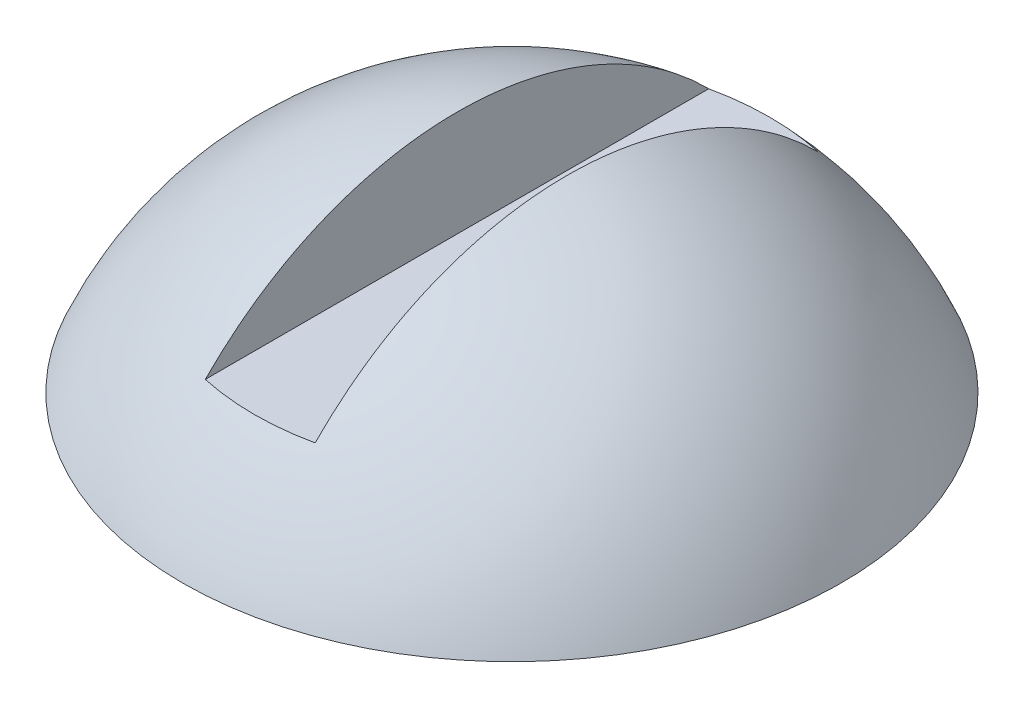
ISO-10303-21;
HEADER;
FILE_DESCRIPTION(('STEP AP214'),'2;1');
FILE_NAME('part.step','',(''),(''),'','','');
FILE_SCHEMA(('AUTOMOTIVE_DESIGN { 1 0 10303 214 1 1 1 1 }'));
ENDSEC;
DATA;
#1=APPLICATION_CONTEXT('core data for automotive mechanical design processes');
#2=APPLICATION_PROTOCOL_DEFINITION('international standard','automotive_design',2000,#1);
#3=PRODUCT_CONTEXT('',#1,'mechanical');
#4=PRODUCT('Part','Part','',(#3));
#5=PRODUCT_RELATED_PRODUCT_CATEGORY('part','',(#4));
#6=PRODUCT_DEFINITION_FORMATION('','',#4);
#7=PRODUCT_DEFINITION_CONTEXT('part definition',#1,'design');
#8=PRODUCT_DEFINITION('design','',#6,#7);
#9=PRODUCT_DEFINITION_SHAPE('','',#8);
#10=(LENGTH_UNIT() NAMED_UNIT(*) SI_UNIT(.MILLI.,.METRE.));
#11=(NAMED_UNIT(*) PLANE_ANGLE_UNIT() SI_UNIT($,.RADIAN.));
#12=(NAMED_UNIT(*) SI_UNIT($,.STERADIAN.) SOLID_ANGLE_UNIT());
#13=UNCERTAINTY_MEASURE_WITH_UNIT(LENGTH_MEASURE(1.E-05),#10,'distance_accuracy_value','');
#14=(GEOMETRIC_REPRESENTATION_CONTEXT(3) GLOBAL_UNCERTAINTY_ASSIGNED_CONTEXT((#13)) GLOBAL_UNIT_ASSIGNED_CONTEXT((#10,
#11,#12)) REPRESENTATION_CONTEXT('',''));
#15=CARTESIAN_POINT('',(0.,0.,0.));
#16=DIRECTION('',(0.,0.,1.));
#17=DIRECTION('',(1.,0.,0.));
#18=AXIS2_PLACEMENT_3D('',#15,#16,#17);
#19=CARTESIAN_POINT('',(0.,-1.25,0.));
#20=DIRECTION('',(0.,1.,0.));
#21=DIRECTION('',(0.,0.,1.));
#22=AXIS2_PLACEMENT_3D('',#19,#20,#21);
#23=SPHERICAL_SURFACE('',#22,3.25);
#24=CARTESIAN_POINT('',(0.,0.,0.));
#25=DIRECTION('',(0.,1.,0.));
#26=DIRECTION('',(0.,0.,1.));
#27=AXIS2_PLACEMENT_3D('',#24,#25,#26);
#28=CIRCLE('',#27,3.);
#29=CARTESIAN_POINT('',(0.,0.,3.));
#30=VERTEX_POINT('',#29);
#31=EDGE_CURVE('E70',#30,#30,#28,.T.);
#32=ORIENTED_EDGE('',*,*,#31,.T.);
#33=EDGE_LOOP('',(#32));
#34=FACE_BOUND('',#33,.T.);
#35=CARTESIAN_POINT('',(-0.5,-1.25,0.));
#36=DIRECTION('',(-1.,0.,0.));
#37=DIRECTION('',(0.,0.,1.));
#38=AXIS2_PLACEMENT_3D('',#35,#36,#37);
#39=CIRCLE('',#38,3.21130814466628);
#40=CARTESIAN_POINT('',(-0.5,1.,-2.29128784747792));
#41=VERTEX_POINT('',#40);
#42=CARTESIAN_POINT('',(-0.499999999999999,1.,2.29128784747792));
#43=VERTEX_POINT('',#42);
#44=EDGE_CURVE('E37',#41,#43,#39,.F.);
#45=ORIENTED_EDGE('',*,*,#44,.F.);
#46=CARTESIAN_POINT('',(0.,1.,0.));
#47=DIRECTION('',(0.,1.,0.));
#48=DIRECTION('',(0.,0.,1.));
#49=AXIS2_PLACEMENT_3D('',#46,#47,#48);
#50=CIRCLE('',#49,2.34520787991172);
#51=CARTESIAN_POINT('',(0.5,1.,-2.29128784747792));
#52=VERTEX_POINT('',#51);
#53=EDGE_CURVE('E11',#41,#52,#50,.F.);
#54=ORIENTED_EDGE('',*,*,#53,.T.);
#55=CARTESIAN_POINT('',(0.5,-1.25,0.));
#56=DIRECTION('',(1.,0.,0.));
#57=DIRECTION('',(0.,0.,-1.));
#58=AXIS2_PLACEMENT_3D('',#55,#56,#57);
#59=CIRCLE('',#58,3.21130814466628);
#60=CARTESIAN_POINT('',(0.499999999999999,1.,2.29128784747792));
#61=VERTEX_POINT('',#60);
#62=EDGE_CURVE('E57',#61,#52,#59,.F.);
#63=ORIENTED_EDGE('',*,*,#62,.F.);
#64=EDGE_CURVE('E43',#61,#43,#50,.F.);
#65=ORIENTED_EDGE('',*,*,#64,.T.);
#66=EDGE_LOOP('',(#45,#54,#63,#65));
#67=FACE_BOUND('',#66,.T.);
#68=ADVANCED_FACE('F34',(#34,#67),#23,.T.);
#69=CARTESIAN_POINT('',(0.,0.,3.));
#70=DIRECTION('',(0.,-1.,0.));
#71=DIRECTION('',(0.,0.,-1.));
#72=AXIS2_PLACEMENT_3D('',#69,#70,#71);
#73=PLANE('',#72);
#74=ORIENTED_EDGE('',*,*,#31,.F.);
#75=EDGE_LOOP('',(#74));
#76=FACE_BOUND('',#75,.T.);
#77=ADVANCED_FACE('F77',(#76),#73,.T.);
#78=CARTESIAN_POINT('',(-0.5,1.,-3.));
#79=DIRECTION('',(-1.,0.,0.));
#80=DIRECTION('',(0.,0.,1.));
#81=AXIS2_PLACEMENT_3D('',#78,#79,#80);
#82=PLANE('',#81);
#83=ORIENTED_EDGE('',*,*,#44,.T.);
#84=DIRECTION('',(0.,0.,1.));
#85=VECTOR('',#84,1.);
#86=CARTESIAN_POINT('',(-0.5,1.,-3.));
#87=LINE('',#86,#85);
#88=EDGE_CURVE('E50',#41,#43,#87,.T.);
#89=ORIENTED_EDGE('',*,*,#88,.F.);
#90=EDGE_LOOP('',(#83,#89));
#91=FACE_BOUND('',#90,.T.);
#92=ADVANCED_FACE('F67',(#91),#82,.F.);
#93=CARTESIAN_POINT('',(0.5,1.,-3.));
#94=DIRECTION('',(1.,0.,0.));
#95=DIRECTION('',(0.,0.,-1.));
#96=AXIS2_PLACEMENT_3D('',#93,#94,#95);
#97=PLANE('',#96);
#98=ORIENTED_EDGE('',*,*,#62,.T.);
#99=DIRECTION('',(0.,0.,-1.));
#100=VECTOR('',#99,1.);
#101=CARTESIAN_POINT('',(0.5,1.,-3.));
#102=LINE('',#101,#100);
#103=EDGE_CURVE('E63',#61,#52,#102,.T.);
#104=ORIENTED_EDGE('',*,*,#103,.F.);
#105=EDGE_LOOP('',(#98,#104));
#106=FACE_BOUND('',#105,.T.);
#107=ADVANCED_FACE('F83',(#106),#97,.F.);
#108=CARTESIAN_POINT('',(0.,1.,0.));
#109=DIRECTION('',(0.,1.,0.));
#110=DIRECTION('',(0.,0.,1.));
#111=AXIS2_PLACEMENT_3D('',#108,#109,#110);
#112=PLANE('',#111);
#113=ORIENTED_EDGE('',*,*,#88,.T.);
#114=ORIENTED_EDGE('',*,*,#64,.F.);
#115=ORIENTED_EDGE('',*,*,#103,.T.);
#116=ORIENTED_EDGE('',*,*,#53,.F.);
#117=EDGE_LOOP('',(#113,#114,#115,#116));
#118=FACE_BOUND('',#117,.T.);
#119=ADVANCED_FACE('F62',(#118),#112,.T.);
#120=CLOSED_SHELL('',(#68,#77,#92,#107,#119));
#121=MANIFOLD_SOLID_BREP('B2',#120);
#122=ADVANCED_BREP_SHAPE_REPRESENTATION('',(#18,#121),#14);
#123=SHAPE_DEFINITION_REPRESENTATION(#9,#122);
ENDSEC;
END-ISO-10303-21;
